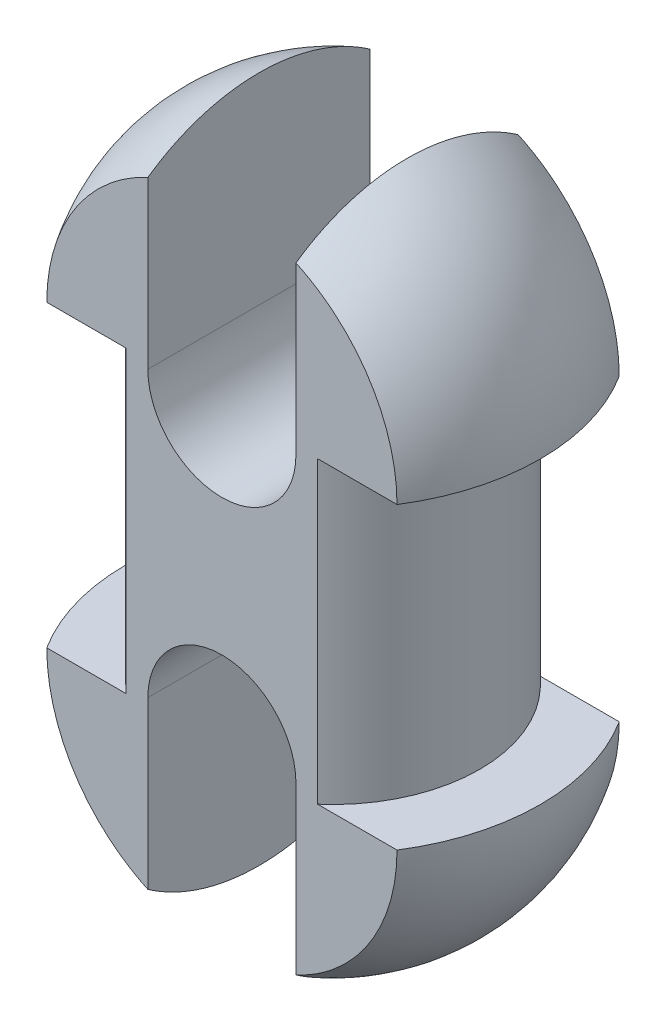
ISO-10303-21;
HEADER;
FILE_DESCRIPTION(('STEP AP214'),'2;1');
FILE_NAME('part.step','',(''),(''),'','','');
FILE_SCHEMA(('AUTOMOTIVE_DESIGN { 1 0 10303 214 1 1 1 1 }'));
ENDSEC;
DATA;
#1=APPLICATION_CONTEXT('core data for automotive mechanical design processes');
#2=APPLICATION_PROTOCOL_DEFINITION('international standard','automotive_design',2000,#1);
#3=PRODUCT_CONTEXT('',#1,'mechanical');
#4=PRODUCT('Part','Part','',(#3));
#5=PRODUCT_RELATED_PRODUCT_CATEGORY('part','',(#4));
#6=PRODUCT_DEFINITION_FORMATION('','',#4);
#7=PRODUCT_DEFINITION_CONTEXT('part definition',#1,'design');
#8=PRODUCT_DEFINITION('design','',#6,#7);
#9=PRODUCT_DEFINITION_SHAPE('','',#8);
#10=(LENGTH_UNIT() NAMED_UNIT(*) SI_UNIT(.MILLI.,.METRE.));
#11=(NAMED_UNIT(*) PLANE_ANGLE_UNIT() SI_UNIT($,.RADIAN.));
#12=(NAMED_UNIT(*) SI_UNIT($,.STERADIAN.) SOLID_ANGLE_UNIT());
#13=UNCERTAINTY_MEASURE_WITH_UNIT(LENGTH_MEASURE(1.E-05),#10,'distance_accuracy_value','');
#14=(GEOMETRIC_REPRESENTATION_CONTEXT(3) GLOBAL_UNCERTAINTY_ASSIGNED_CONTEXT((#13)) GLOBAL_UNIT_ASSIGNED_CONTEXT((#10,
#11,#12)) REPRESENTATION_CONTEXT('',''));
#15=CARTESIAN_POINT('',(0.,0.,0.));
#16=DIRECTION('',(0.,0.,1.));
#17=DIRECTION('',(1.,0.,0.));
#18=AXIS2_PLACEMENT_3D('',#15,#16,#17);
#19=CARTESIAN_POINT('',(0.,10.1,0.));
#20=DIRECTION('',(0.,-1.,0.));
#21=DIRECTION('',(1.,0.,0.));
#22=AXIS2_PLACEMENT_3D('',#19,#20,#21);
#23=SPHERICAL_SURFACE('',#22,14.);
#24=CARTESIAN_POINT('',(-4.99999999999999,10.1,0.));
#25=DIRECTION('',(-1.,0.,0.));
#26=DIRECTION('',(0.,-1.,0.));
#27=AXIS2_PLACEMENT_3D('',#24,#25,#26);
#28=CIRCLE('',#27,13.076696830622);
#29=CARTESIAN_POINT('',(-4.99999999999999,20.8121426428143,-7.5));
#30=VERTEX_POINT('',#29);
#31=CARTESIAN_POINT('',(-4.99999999999999,20.8121426428143,7.5));
#32=VERTEX_POINT('',#31);
#33=EDGE_CURVE('E182',#30,#32,#28,.F.);
#34=ORIENTED_EDGE('',*,*,#33,.F.);
#35=CARTESIAN_POINT('',(0.,10.1,-7.5));
#36=DIRECTION('',(0.,0.,-1.));
#37=DIRECTION('',(-1.,0.,0.));
#38=AXIS2_PLACEMENT_3D('',#35,#36,#37);
#39=CIRCLE('',#38,11.8215904175369);
#40=CARTESIAN_POINT('',(-11.8215904175369,10.1,-7.5));
#41=VERTEX_POINT('',#40);
#42=EDGE_CURVE('E253',#30,#41,#39,.F.);
#43=ORIENTED_EDGE('',*,*,#42,.T.);
#44=CARTESIAN_POINT('',(0.,10.1,0.));
#45=DIRECTION('',(0.,-1.,0.));
#46=DIRECTION('',(0.,0.,-1.));
#47=AXIS2_PLACEMENT_3D('',#44,#45,#46);
#48=CIRCLE('',#47,14.);
#49=CARTESIAN_POINT('',(-14.,10.1,0.));
#50=VERTEX_POINT('',#49);
#51=EDGE_CURVE('E287',#50,#41,#48,.T.);
#52=ORIENTED_EDGE('',*,*,#51,.F.);
#53=CARTESIAN_POINT('',(-11.8215904175369,10.1,7.5));
#54=VERTEX_POINT('',#53);
#55=EDGE_CURVE('E363',#54,#50,#48,.T.);
#56=ORIENTED_EDGE('',*,*,#55,.F.);
#57=CARTESIAN_POINT('',(0.,10.1,7.5));
#58=DIRECTION('',(0.,0.,1.));
#59=DIRECTION('',(1.,0.,0.));
#60=AXIS2_PLACEMENT_3D('',#57,#58,#59);
#61=CIRCLE('',#60,11.8215904175369);
#62=EDGE_CURVE('E268',#54,#32,#61,.F.);
#63=ORIENTED_EDGE('',*,*,#62,.T.);
#64=EDGE_LOOP('',(#34,#43,#52,#56,#63));
#65=FACE_BOUND('',#64,.T.);
#66=ADVANCED_FACE('F42',(#65),#23,.T.);
#67=CARTESIAN_POINT('',(0.,-10.1,0.));
#68=DIRECTION('',(0.,-1.,0.));
#69=DIRECTION('',(-1.,0.,0.));
#70=AXIS2_PLACEMENT_3D('',#67,#68,#69);
#71=SPHERICAL_SURFACE('',#70,14.);
#72=CARTESIAN_POINT('',(5.,-10.1,0.));
#73=DIRECTION('',(1.,0.,0.));
#74=DIRECTION('',(0.,0.,-1.));
#75=AXIS2_PLACEMENT_3D('',#72,#73,#74);
#76=CIRCLE('',#75,13.076696830622);
#77=CARTESIAN_POINT('',(5.,-20.8121426428143,-7.5));
#78=VERTEX_POINT('',#77);
#79=CARTESIAN_POINT('',(5.,-20.8121426428143,7.5));
#80=VERTEX_POINT('',#79);
#81=EDGE_CURVE('E227',#78,#80,#76,.F.);
#82=ORIENTED_EDGE('',*,*,#81,.F.);
#83=CARTESIAN_POINT('',(0.,-10.1,-7.5));
#84=DIRECTION('',(0.,0.,-1.));
#85=DIRECTION('',(-1.,0.,0.));
#86=AXIS2_PLACEMENT_3D('',#83,#84,#85);
#87=CIRCLE('',#86,11.8215904175369);
#88=CARTESIAN_POINT('',(11.8215904175369,-10.1,-7.5));
#89=VERTEX_POINT('',#88);
#90=EDGE_CURVE('E238',#78,#89,#87,.F.);
#91=ORIENTED_EDGE('',*,*,#90,.T.);
#92=CARTESIAN_POINT('',(0.,-10.1,0.));
#93=DIRECTION('',(0.,-1.,0.));
#94=DIRECTION('',(0.,0.,-1.));
#95=AXIS2_PLACEMENT_3D('',#92,#93,#94);
#96=CIRCLE('',#95,14.);
#97=CARTESIAN_POINT('',(14.,-10.1,0.));
#98=VERTEX_POINT('',#97);
#99=EDGE_CURVE('E283',#89,#98,#96,.T.);
#100=ORIENTED_EDGE('',*,*,#99,.T.);
#101=CARTESIAN_POINT('',(11.8215904175369,-10.1,7.5));
#102=VERTEX_POINT('',#101);
#103=EDGE_CURVE('E288',#98,#102,#96,.T.);
#104=ORIENTED_EDGE('',*,*,#103,.T.);
#105=CARTESIAN_POINT('',(0.,-10.1,7.5));
#106=DIRECTION('',(0.,0.,1.));
#107=DIRECTION('',(1.,0.,0.));
#108=AXIS2_PLACEMENT_3D('',#105,#106,#107);
#109=CIRCLE('',#108,11.8215904175369);
#110=EDGE_CURVE('E259',#102,#80,#109,.F.);
#111=ORIENTED_EDGE('',*,*,#110,.T.);
#112=EDGE_LOOP('',(#82,#91,#100,#104,#111));
#113=FACE_BOUND('',#112,.T.);
#114=ADVANCED_FACE('F328',(#113),#71,.T.);
#115=CARTESIAN_POINT('',(0.,10.1,0.));
#116=DIRECTION('',(0.,1.,0.));
#117=DIRECTION('',(0.,0.,1.));
#118=AXIS2_PLACEMENT_3D('',#115,#116,#117);
#119=PLANE('',#118);
#120=DIRECTION('',(1.,0.,0.));
#121=VECTOR('',#120,1.);
#122=CARTESIAN_POINT('',(0.,10.1,7.5));
#123=LINE('',#122,#121);
#124=CARTESIAN_POINT('',(-6.46219776856141,10.1,7.5));
#125=VERTEX_POINT('',#124);
#126=EDGE_CURVE('E267',#54,#125,#123,.T.);
#127=ORIENTED_EDGE('',*,*,#126,.F.);
#128=ORIENTED_EDGE('',*,*,#55,.T.);
#129=ORIENTED_EDGE('',*,*,#51,.T.);
#130=DIRECTION('',(-1.,0.,0.));
#131=VECTOR('',#130,1.);
#132=CARTESIAN_POINT('',(0.,10.1,-7.5));
#133=LINE('',#132,#131);
#134=CARTESIAN_POINT('',(-6.46219776856141,10.1,-7.5));
#135=VERTEX_POINT('',#134);
#136=EDGE_CURVE('E244',#135,#41,#133,.T.);
#137=ORIENTED_EDGE('',*,*,#136,.F.);
#138=CARTESIAN_POINT('',(0.,10.1,0.));
#139=DIRECTION('',(0.,-1.,0.));
#140=DIRECTION('',(0.,0.,-1.));
#141=AXIS2_PLACEMENT_3D('',#138,#139,#140);
#142=CIRCLE('',#141,9.9);
#143=EDGE_CURVE('E277',#125,#135,#142,.T.);
#144=ORIENTED_EDGE('',*,*,#143,.F.);
#145=EDGE_LOOP('',(#127,#128,#129,#137,#144));
#146=FACE_BOUND('',#145,.T.);
#147=ADVANCED_FACE('F44',(#146),#119,.F.);
#148=CARTESIAN_POINT('',(6.46219776856141,10.1,7.5));
#149=VERTEX_POINT('',#148);
#150=CARTESIAN_POINT('',(11.8215904175369,10.1,7.5));
#151=VERTEX_POINT('',#150);
#152=EDGE_CURVE('E263',#149,#151,#123,.T.);
#153=ORIENTED_EDGE('',*,*,#152,.F.);
#154=CARTESIAN_POINT('',(6.46219776856141,10.1,-7.5));
#155=VERTEX_POINT('',#154);
#156=EDGE_CURVE('E272',#155,#149,#142,.T.);
#157=ORIENTED_EDGE('',*,*,#156,.F.);
#158=CARTESIAN_POINT('',(11.8215904175369,10.1,-7.5));
#159=VERTEX_POINT('',#158);
#160=EDGE_CURVE('E248',#159,#155,#133,.T.);
#161=ORIENTED_EDGE('',*,*,#160,.F.);
#162=CARTESIAN_POINT('',(14.,10.1,0.));
#163=VERTEX_POINT('',#162);
#164=EDGE_CURVE('E289',#159,#163,#48,.T.);
#165=ORIENTED_EDGE('',*,*,#164,.T.);
#166=EDGE_CURVE('E294',#163,#151,#48,.T.);
#167=ORIENTED_EDGE('',*,*,#166,.T.);
#168=EDGE_LOOP('',(#153,#157,#161,#165,#167));
#169=FACE_BOUND('',#168,.T.);
#170=ADVANCED_FACE('F379',(#169),#119,.F.);
#171=CARTESIAN_POINT('',(4.99999999999999,10.1,0.));
#172=DIRECTION('',(1.,0.,0.));
#173=DIRECTION('',(0.,1.,0.));
#174=AXIS2_PLACEMENT_3D('',#171,#172,#173);
#175=CIRCLE('',#174,13.076696830622);
#176=CARTESIAN_POINT('',(4.99999999999999,20.8121426428143,7.5));
#177=VERTEX_POINT('',#176);
#178=CARTESIAN_POINT('',(4.99999999999999,20.8121426428143,-7.5));
#179=VERTEX_POINT('',#178);
#180=EDGE_CURVE('E230',#177,#179,#175,.F.);
#181=ORIENTED_EDGE('',*,*,#180,.F.);
#182=EDGE_CURVE('E271',#177,#151,#61,.F.);
#183=ORIENTED_EDGE('',*,*,#182,.T.);
#184=ORIENTED_EDGE('',*,*,#166,.F.);
#185=ORIENTED_EDGE('',*,*,#164,.F.);
#186=EDGE_CURVE('E249',#159,#179,#39,.F.);
#187=ORIENTED_EDGE('',*,*,#186,.T.);
#188=EDGE_LOOP('',(#181,#183,#184,#185,#187));
#189=FACE_BOUND('',#188,.T.);
#190=ADVANCED_FACE('F376',(#189),#23,.T.);
#191=CARTESIAN_POINT('',(-5.00000000000001,-10.1,0.));
#192=DIRECTION('',(-1.,0.,0.));
#193=DIRECTION('',(0.,0.,1.));
#194=AXIS2_PLACEMENT_3D('',#191,#192,#193);
#195=CIRCLE('',#194,13.076696830622);
#196=CARTESIAN_POINT('',(-5.00000000000001,-20.8121426428143,7.5));
#197=VERTEX_POINT('',#196);
#198=CARTESIAN_POINT('',(-5.00000000000001,-20.8121426428143,-7.5));
#199=VERTEX_POINT('',#198);
#200=EDGE_CURVE('E175',#197,#199,#195,.F.);
#201=ORIENTED_EDGE('',*,*,#200,.F.);
#202=CARTESIAN_POINT('',(-11.8215904175369,-10.1,7.5));
#203=VERTEX_POINT('',#202);
#204=EDGE_CURVE('E257',#197,#203,#109,.F.);
#205=ORIENTED_EDGE('',*,*,#204,.T.);
#206=CARTESIAN_POINT('',(-14.,-10.1,0.));
#207=VERTEX_POINT('',#206);
#208=EDGE_CURVE('E341',#203,#207,#96,.T.);
#209=ORIENTED_EDGE('',*,*,#208,.T.);
#210=CARTESIAN_POINT('',(-11.8215904175369,-10.1,-7.5));
#211=VERTEX_POINT('',#210);
#212=EDGE_CURVE('E282',#207,#211,#96,.T.);
#213=ORIENTED_EDGE('',*,*,#212,.T.);
#214=EDGE_CURVE('E240',#211,#199,#87,.F.);
#215=ORIENTED_EDGE('',*,*,#214,.T.);
#216=EDGE_LOOP('',(#201,#205,#209,#213,#215));
#217=FACE_BOUND('',#216,.T.);
#218=ADVANCED_FACE('F313',(#217),#71,.T.);
#219=CARTESIAN_POINT('',(0.,-10.1,0.));
#220=DIRECTION('',(0.,-1.,0.));
#221=DIRECTION('',(0.,0.,-1.));
#222=AXIS2_PLACEMENT_3D('',#219,#220,#221);
#223=PLANE('',#222);
#224=DIRECTION('',(-1.,0.,0.));
#225=VECTOR('',#224,1.);
#226=CARTESIAN_POINT('',(0.,-10.1,7.5));
#227=LINE('',#226,#225);
#228=CARTESIAN_POINT('',(6.46219776856141,-10.1,7.5));
#229=VERTEX_POINT('',#228);
#230=EDGE_CURVE('E254',#102,#229,#227,.T.);
#231=ORIENTED_EDGE('',*,*,#230,.F.);
#232=ORIENTED_EDGE('',*,*,#103,.F.);
#233=ORIENTED_EDGE('',*,*,#99,.F.);
#234=DIRECTION('',(1.,0.,0.));
#235=VECTOR('',#234,1.);
#236=CARTESIAN_POINT('',(0.,-10.1,-7.5));
#237=LINE('',#236,#235);
#238=CARTESIAN_POINT('',(6.46219776856141,-10.1,-7.5));
#239=VERTEX_POINT('',#238);
#240=EDGE_CURVE('E239',#239,#89,#237,.T.);
#241=ORIENTED_EDGE('',*,*,#240,.F.);
#242=CARTESIAN_POINT('',(0.,-10.1,0.));
#243=DIRECTION('',(0.,-1.,0.));
#244=DIRECTION('',(0.,0.,-1.));
#245=AXIS2_PLACEMENT_3D('',#242,#243,#244);
#246=CIRCLE('',#245,9.9);
#247=EDGE_CURVE('E278',#239,#229,#246,.T.);
#248=ORIENTED_EDGE('',*,*,#247,.T.);
#249=EDGE_LOOP('',(#231,#232,#233,#241,#248));
#250=FACE_BOUND('',#249,.T.);
#251=ADVANCED_FACE('F339',(#250),#223,.F.);
#252=CARTESIAN_POINT('',(-6.46219776856141,-10.1,7.5));
#253=VERTEX_POINT('',#252);
#254=EDGE_CURVE('E258',#253,#203,#227,.T.);
#255=ORIENTED_EDGE('',*,*,#254,.F.);
#256=CARTESIAN_POINT('',(-6.46219776856141,-10.1,-7.5));
#257=VERTEX_POINT('',#256);
#258=EDGE_CURVE('E276',#253,#257,#246,.T.);
#259=ORIENTED_EDGE('',*,*,#258,.T.);
#260=EDGE_CURVE('E235',#211,#257,#237,.T.);
#261=ORIENTED_EDGE('',*,*,#260,.F.);
#262=ORIENTED_EDGE('',*,*,#212,.F.);
#263=ORIENTED_EDGE('',*,*,#208,.F.);
#264=EDGE_LOOP('',(#255,#259,#261,#262,#263));
#265=FACE_BOUND('',#264,.T.);
#266=ADVANCED_FACE('F346',(#265),#223,.F.);
#267=CARTESIAN_POINT('',(0.,-24.1,0.));
#268=DIRECTION('',(0.,-1.,0.));
#269=DIRECTION('',(0.,0.,-1.));
#270=AXIS2_PLACEMENT_3D('',#267,#268,#269);
#271=CYLINDRICAL_SURFACE('',#270,9.9);
#272=DIRECTION('',(0.,-1.,0.));
#273=VECTOR('',#272,1.);
#274=CARTESIAN_POINT('',(-6.46219776856141,-24.1,7.5));
#275=LINE('',#274,#273);
#276=EDGE_CURVE('E303',#125,#253,#275,.T.);
#277=ORIENTED_EDGE('',*,*,#276,.F.);
#278=ORIENTED_EDGE('',*,*,#143,.T.);
#279=DIRECTION('',(0.,-1.,0.));
#280=VECTOR('',#279,1.);
#281=CARTESIAN_POINT('',(-6.46219776856141,-24.1,-7.5));
#282=LINE('',#281,#280);
#283=EDGE_CURVE('E293',#257,#135,#282,.F.);
#284=ORIENTED_EDGE('',*,*,#283,.F.);
#285=ORIENTED_EDGE('',*,*,#258,.F.);
#286=EDGE_LOOP('',(#277,#278,#284,#285));
#287=FACE_BOUND('',#286,.T.);
#288=ADVANCED_FACE('F354',(#287),#271,.T.);
#289=DIRECTION('',(0.,-1.,0.));
#290=VECTOR('',#289,1.);
#291=CARTESIAN_POINT('',(6.46219776856141,-24.1,7.5));
#292=LINE('',#291,#290);
#293=EDGE_CURVE('E300',#229,#149,#292,.F.);
#294=ORIENTED_EDGE('',*,*,#293,.F.);
#295=ORIENTED_EDGE('',*,*,#247,.F.);
#296=DIRECTION('',(0.,-1.,0.));
#297=VECTOR('',#296,1.);
#298=CARTESIAN_POINT('',(6.46219776856141,-24.1,-7.5));
#299=LINE('',#298,#297);
#300=EDGE_CURVE('E297',#155,#239,#299,.T.);
#301=ORIENTED_EDGE('',*,*,#300,.F.);
#302=ORIENTED_EDGE('',*,*,#156,.T.);
#303=EDGE_LOOP('',(#294,#295,#301,#302));
#304=FACE_BOUND('',#303,.T.);
#305=ADVANCED_FACE('F383',(#304),#271,.T.);
#306=CARTESIAN_POINT('',(-14.,-24.1,-7.5));
#307=DIRECTION('',(0.,0.,-1.));
#308=DIRECTION('',(-1.,0.,0.));
#309=AXIS2_PLACEMENT_3D('',#306,#307,#308);
#310=PLANE('',#309);
#311=DIRECTION('',(0.,1.,0.));
#312=VECTOR('',#311,1.);
#313=CARTESIAN_POINT('',(-4.99999999999999,24.1,-7.5));
#314=LINE('',#313,#312);
#315=CARTESIAN_POINT('',(-4.99999999999999,9.6,-7.5));
#316=VERTEX_POINT('',#315);
#317=EDGE_CURVE('E191',#316,#30,#314,.T.);
#318=ORIENTED_EDGE('',*,*,#317,.F.);
#319=CARTESIAN_POINT('',(0.,9.6,-7.5));
#320=DIRECTION('',(0.,0.,-1.));
#321=DIRECTION('',(-1.,0.,0.));
#322=AXIS2_PLACEMENT_3D('',#319,#320,#321);
#323=CIRCLE('',#322,4.99999999999999);
#324=CARTESIAN_POINT('',(4.99999999999999,9.59999999999999,-7.5));
#325=VERTEX_POINT('',#324);
#326=EDGE_CURVE('E171',#325,#316,#323,.T.);
#327=ORIENTED_EDGE('',*,*,#326,.F.);
#328=DIRECTION('',(0.,-1.,0.));
#329=VECTOR('',#328,1.);
#330=CARTESIAN_POINT('',(4.99999999999999,24.1,-7.5));
#331=LINE('',#330,#329);
#332=EDGE_CURVE('E196',#179,#325,#331,.T.);
#333=ORIENTED_EDGE('',*,*,#332,.F.);
#334=ORIENTED_EDGE('',*,*,#186,.F.);
#335=ORIENTED_EDGE('',*,*,#160,.T.);
#336=ORIENTED_EDGE('',*,*,#300,.T.);
#337=ORIENTED_EDGE('',*,*,#240,.T.);
#338=ORIENTED_EDGE('',*,*,#90,.F.);
#339=DIRECTION('',(0.,-1.,0.));
#340=VECTOR('',#339,1.);
#341=CARTESIAN_POINT('',(5.,-24.1,-7.5));
#342=LINE('',#341,#340);
#343=CARTESIAN_POINT('',(5.,-9.6,-7.5));
#344=VERTEX_POINT('',#343);
#345=EDGE_CURVE('E207',#344,#78,#342,.T.);
#346=ORIENTED_EDGE('',*,*,#345,.F.);
#347=CARTESIAN_POINT('',(0.,-9.6,-7.5));
#348=DIRECTION('',(0.,0.,-1.));
#349=DIRECTION('',(-1.,0.,0.));
#350=AXIS2_PLACEMENT_3D('',#347,#348,#349);
#351=CIRCLE('',#350,5.00000000000001);
#352=CARTESIAN_POINT('',(-5.00000000000001,-9.6,-7.5));
#353=VERTEX_POINT('',#352);
#354=EDGE_CURVE('E215',#353,#344,#351,.T.);
#355=ORIENTED_EDGE('',*,*,#354,.F.);
#356=DIRECTION('',(0.,1.,0.));
#357=VECTOR('',#356,1.);
#358=CARTESIAN_POINT('',(-5.00000000000001,-24.1,-7.5));
#359=LINE('',#358,#357);
#360=EDGE_CURVE('E212',#199,#353,#359,.T.);
#361=ORIENTED_EDGE('',*,*,#360,.F.);
#362=ORIENTED_EDGE('',*,*,#214,.F.);
#363=ORIENTED_EDGE('',*,*,#260,.T.);
#364=ORIENTED_EDGE('',*,*,#283,.T.);
#365=ORIENTED_EDGE('',*,*,#136,.T.);
#366=ORIENTED_EDGE('',*,*,#42,.F.);
#367=EDGE_LOOP('',(#318,#327,#333,#334,#335,#336,#337,#338,#346,#355,#361,#362,#363,#364,#365,#366));
#368=FACE_BOUND('',#367,.T.);
#369=ADVANCED_FACE('F334',(#368),#310,.T.);
#370=CARTESIAN_POINT('',(-14.,-24.1,7.5));
#371=DIRECTION('',(0.,0.,1.));
#372=DIRECTION('',(1.,0.,0.));
#373=AXIS2_PLACEMENT_3D('',#370,#371,#372);
#374=PLANE('',#373);
#375=DIRECTION('',(0.,1.,0.));
#376=VECTOR('',#375,1.);
#377=CARTESIAN_POINT('',(-4.99999999999999,24.1,7.5));
#378=LINE('',#377,#376);
#379=CARTESIAN_POINT('',(-4.99999999999999,9.6,7.5));
#380=VERTEX_POINT('',#379);
#381=EDGE_CURVE('E179',#380,#32,#378,.T.);
#382=ORIENTED_EDGE('',*,*,#381,.T.);
#383=ORIENTED_EDGE('',*,*,#62,.F.);
#384=ORIENTED_EDGE('',*,*,#126,.T.);
#385=ORIENTED_EDGE('',*,*,#276,.T.);
#386=ORIENTED_EDGE('',*,*,#254,.T.);
#387=ORIENTED_EDGE('',*,*,#204,.F.);
#388=DIRECTION('',(0.,-1.,0.));
#389=VECTOR('',#388,1.);
#390=CARTESIAN_POINT('',(-5.00000000000001,-24.1,7.5));
#391=LINE('',#390,#389);
#392=CARTESIAN_POINT('',(-5.00000000000001,-9.6,7.5));
#393=VERTEX_POINT('',#392);
#394=EDGE_CURVE('E51',#393,#197,#391,.T.);
#395=ORIENTED_EDGE('',*,*,#394,.F.);
#396=CARTESIAN_POINT('',(0.,-9.6,7.5));
#397=DIRECTION('',(0.,0.,-1.));
#398=DIRECTION('',(-1.,0.,0.));
#399=AXIS2_PLACEMENT_3D('',#396,#397,#398);
#400=CIRCLE('',#399,5.00000000000001);
#401=CARTESIAN_POINT('',(5.,-9.6,7.5));
#402=VERTEX_POINT('',#401);
#403=EDGE_CURVE('E66',#393,#402,#400,.T.);
#404=ORIENTED_EDGE('',*,*,#403,.T.);
#405=DIRECTION('',(0.,-1.,0.));
#406=VECTOR('',#405,1.);
#407=CARTESIAN_POINT('',(5.,-24.1,7.5));
#408=LINE('',#407,#406);
#409=EDGE_CURVE('E206',#402,#80,#408,.T.);
#410=ORIENTED_EDGE('',*,*,#409,.T.);
#411=ORIENTED_EDGE('',*,*,#110,.F.);
#412=ORIENTED_EDGE('',*,*,#230,.T.);
#413=ORIENTED_EDGE('',*,*,#293,.T.);
#414=ORIENTED_EDGE('',*,*,#152,.T.);
#415=ORIENTED_EDGE('',*,*,#182,.F.);
#416=DIRECTION('',(0.,1.,0.));
#417=VECTOR('',#416,1.);
#418=CARTESIAN_POINT('',(4.99999999999998,-24.1,7.5));
#419=LINE('',#418,#417);
#420=CARTESIAN_POINT('',(4.99999999999999,9.59999999999999,7.5));
#421=VERTEX_POINT('',#420);
#422=EDGE_CURVE('E12',#421,#177,#419,.T.);
#423=ORIENTED_EDGE('',*,*,#422,.F.);
#424=CARTESIAN_POINT('',(0.,9.6,7.5));
#425=DIRECTION('',(0.,0.,-1.));
#426=DIRECTION('',(-1.,0.,0.));
#427=AXIS2_PLACEMENT_3D('',#424,#425,#426);
#428=CIRCLE('',#427,4.99999999999999);
#429=EDGE_CURVE('E58',#421,#380,#428,.T.);
#430=ORIENTED_EDGE('',*,*,#429,.T.);
#431=EDGE_LOOP('',(#382,#383,#384,#385,#386,#387,#395,#404,#410,#411,#412,#413,#414,#415,#423,#430));
#432=FACE_BOUND('',#431,.T.);
#433=ADVANCED_FACE('F188',(#432),#374,.T.);
#434=CARTESIAN_POINT('',(5.,-24.1,7.5));
#435=DIRECTION('',(1.,0.,0.));
#436=DIRECTION('',(0.,0.,-1.));
#437=AXIS2_PLACEMENT_3D('',#434,#435,#436);
#438=PLANE('',#437);
#439=ORIENTED_EDGE('',*,*,#81,.T.);
#440=ORIENTED_EDGE('',*,*,#409,.F.);
#441=DIRECTION('',(0.,0.,-1.));
#442=VECTOR('',#441,1.);
#443=CARTESIAN_POINT('',(5.,-9.6,7.5));
#444=LINE('',#443,#442);
#445=EDGE_CURVE('E199',#402,#344,#444,.T.);
#446=ORIENTED_EDGE('',*,*,#445,.T.);
#447=ORIENTED_EDGE('',*,*,#345,.T.);
#448=EDGE_LOOP('',(#439,#440,#446,#447));
#449=FACE_BOUND('',#448,.T.);
#450=ADVANCED_FACE('F386',(#449),#438,.F.);
#451=CARTESIAN_POINT('',(0.,-9.6,7.5));
#452=DIRECTION('',(0.,0.,-1.));
#453=DIRECTION('',(-1.,0.,0.));
#454=AXIS2_PLACEMENT_3D('',#451,#452,#453);
#455=CYLINDRICAL_SURFACE('',#454,5.00000000000001);
#456=ORIENTED_EDGE('',*,*,#354,.T.);
#457=ORIENTED_EDGE('',*,*,#445,.F.);
#458=ORIENTED_EDGE('',*,*,#403,.F.);
#459=DIRECTION('',(0.,0.,-1.));
#460=VECTOR('',#459,1.);
#461=CARTESIAN_POINT('',(-5.00000000000001,-9.6,7.5));
#462=LINE('',#461,#460);
#463=EDGE_CURVE('E211',#393,#353,#462,.T.);
#464=ORIENTED_EDGE('',*,*,#463,.T.);
#465=EDGE_LOOP('',(#456,#457,#458,#464));
#466=FACE_BOUND('',#465,.T.);
#467=ADVANCED_FACE('F388',(#466),#455,.F.);
#468=CARTESIAN_POINT('',(-5.00000000000001,-24.1,7.5));
#469=DIRECTION('',(-1.,0.,0.));
#470=DIRECTION('',(0.,0.,1.));
#471=AXIS2_PLACEMENT_3D('',#468,#469,#470);
#472=PLANE('',#471);
#473=ORIENTED_EDGE('',*,*,#200,.T.);
#474=ORIENTED_EDGE('',*,*,#360,.T.);
#475=ORIENTED_EDGE('',*,*,#463,.F.);
#476=ORIENTED_EDGE('',*,*,#394,.T.);
#477=EDGE_LOOP('',(#473,#474,#475,#476));
#478=FACE_BOUND('',#477,.T.);
#479=ADVANCED_FACE('F309',(#478),#472,.F.);
#480=CARTESIAN_POINT('',(-4.99999999999999,24.1,7.5));
#481=DIRECTION('',(-1.,0.,0.));
#482=DIRECTION('',(0.,-1.,0.));
#483=AXIS2_PLACEMENT_3D('',#480,#481,#482);
#484=PLANE('',#483);
#485=ORIENTED_EDGE('',*,*,#33,.T.);
#486=ORIENTED_EDGE('',*,*,#381,.F.);
#487=DIRECTION('',(0.,0.,-1.));
#488=VECTOR('',#487,1.);
#489=CARTESIAN_POINT('',(-4.99999999999999,9.6,7.5));
#490=LINE('',#489,#488);
#491=EDGE_CURVE('E167',#380,#316,#490,.T.);
#492=ORIENTED_EDGE('',*,*,#491,.T.);
#493=ORIENTED_EDGE('',*,*,#317,.T.);
#494=EDGE_LOOP('',(#485,#486,#492,#493));
#495=FACE_BOUND('',#494,.T.);
#496=ADVANCED_FACE('F180',(#495),#484,.F.);
#497=CARTESIAN_POINT('',(0.,9.6,7.5));
#498=DIRECTION('',(0.,0.,-1.));
#499=DIRECTION('',(-1.,0.,0.));
#500=AXIS2_PLACEMENT_3D('',#497,#498,#499);
#501=CYLINDRICAL_SURFACE('',#500,4.99999999999999);
#502=ORIENTED_EDGE('',*,*,#326,.T.);
#503=ORIENTED_EDGE('',*,*,#491,.F.);
#504=ORIENTED_EDGE('',*,*,#429,.F.);
#505=DIRECTION('',(0.,0.,-1.));
#506=VECTOR('',#505,1.);
#507=CARTESIAN_POINT('',(4.99999999999999,9.59999999999999,7.5));
#508=LINE('',#507,#506);
#509=EDGE_CURVE('E176',#421,#325,#508,.T.);
#510=ORIENTED_EDGE('',*,*,#509,.T.);
#511=EDGE_LOOP('',(#502,#503,#504,#510));
#512=FACE_BOUND('',#511,.T.);
#513=ADVANCED_FACE('F169',(#512),#501,.F.);
#514=CARTESIAN_POINT('',(4.99999999999999,24.1,7.5));
#515=DIRECTION('',(1.,0.,0.));
#516=DIRECTION('',(0.,1.,0.));
#517=AXIS2_PLACEMENT_3D('',#514,#515,#516);
#518=PLANE('',#517);
#519=ORIENTED_EDGE('',*,*,#180,.T.);
#520=ORIENTED_EDGE('',*,*,#332,.T.);
#521=ORIENTED_EDGE('',*,*,#509,.F.);
#522=ORIENTED_EDGE('',*,*,#422,.T.);
#523=EDGE_LOOP('',(#519,#520,#521,#522));
#524=FACE_BOUND('',#523,.T.);
#525=ADVANCED_FACE('F482',(#524),#518,.F.);
#526=CLOSED_SHELL('',(#66,#114,#147,#170,#190,#218,#251,#266,#288,#305,#369,#433,#450,#467,#479,
#496,#513,#525));
#527=MANIFOLD_SOLID_BREP('B2',#526);
#528=ADVANCED_BREP_SHAPE_REPRESENTATION('',(#18,#527),#14);
#529=SHAPE_DEFINITION_REPRESENTATION(#9,#528);
ENDSEC;
END-ISO-10303-21;
